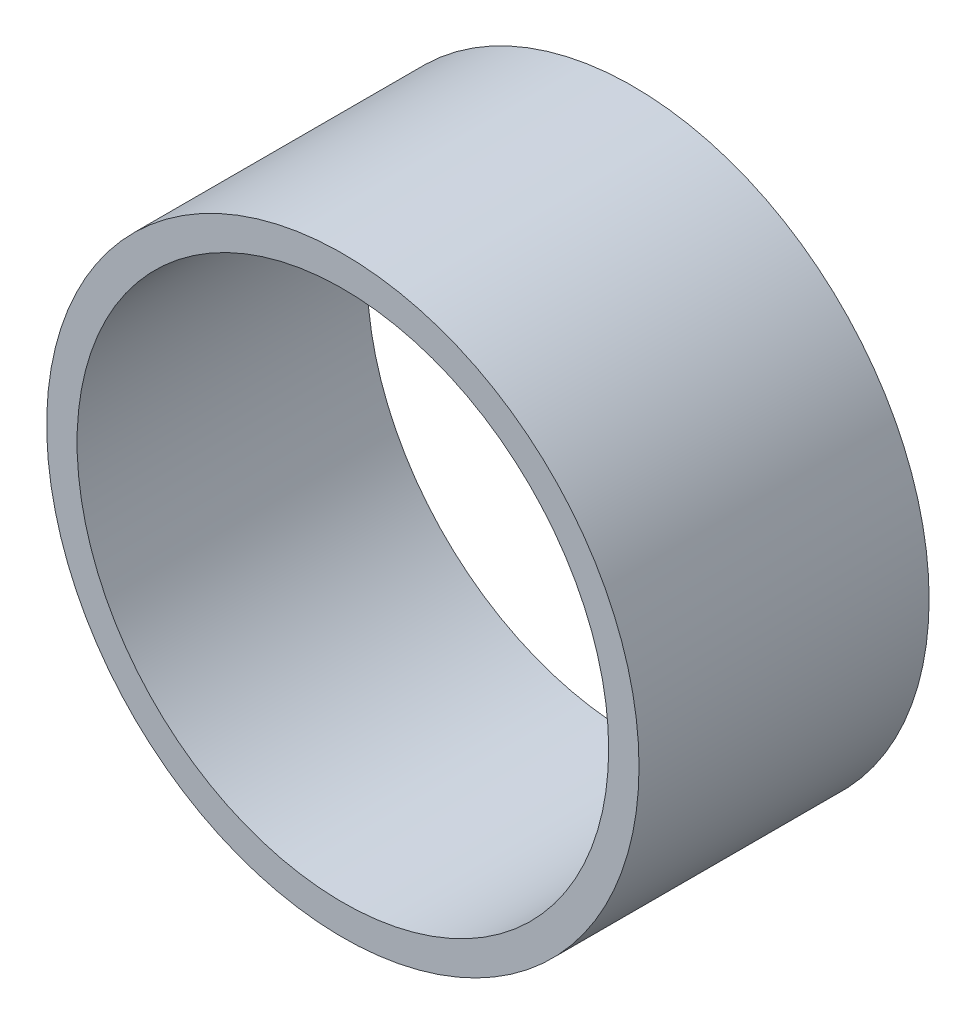
ISO-10303-21;
HEADER;
FILE_DESCRIPTION(('STEP AP214'),'2;1');
FILE_NAME('part.step','',(''),(''),'','','');
FILE_SCHEMA(('AUTOMOTIVE_DESIGN { 1 0 10303 214 1 1 1 1 }'));
ENDSEC;
DATA;
#1=APPLICATION_CONTEXT('core data for automotive mechanical design processes');
#2=APPLICATION_PROTOCOL_DEFINITION('international standard','automotive_design',2000,#1);
#3=PRODUCT_CONTEXT('',#1,'mechanical');
#4=PRODUCT('Part','Part','',(#3));
#5=PRODUCT_RELATED_PRODUCT_CATEGORY('part','',(#4));
#6=PRODUCT_DEFINITION_FORMATION('','',#4);
#7=PRODUCT_DEFINITION_CONTEXT('part definition',#1,'design');
#8=PRODUCT_DEFINITION('design','',#6,#7);
#9=PRODUCT_DEFINITION_SHAPE('','',#8);
#10=(LENGTH_UNIT() NAMED_UNIT(*) SI_UNIT(.MILLI.,.METRE.));
#11=(NAMED_UNIT(*) PLANE_ANGLE_UNIT() SI_UNIT($,.RADIAN.));
#12=(NAMED_UNIT(*) SI_UNIT($,.STERADIAN.) SOLID_ANGLE_UNIT());
#13=UNCERTAINTY_MEASURE_WITH_UNIT(LENGTH_MEASURE(1.E-05),#10,'distance_accuracy_value','');
#14=(GEOMETRIC_REPRESENTATION_CONTEXT(3) GLOBAL_UNCERTAINTY_ASSIGNED_CONTEXT((#13)) GLOBAL_UNIT_ASSIGNED_CONTEXT((#10,
#11,#12)) REPRESENTATION_CONTEXT('',''));
#15=CARTESIAN_POINT('',(0.,0.,0.));
#16=DIRECTION('',(0.,0.,1.));
#17=DIRECTION('',(1.,0.,0.));
#18=AXIS2_PLACEMENT_3D('',#15,#16,#17);
#19=CARTESIAN_POINT('',(0.,0.,2.5));
#20=DIRECTION('',(0.,0.,1.));
#21=DIRECTION('',(1.,0.,0.));
#22=AXIS2_PLACEMENT_3D('',#19,#20,#21);
#23=PLANE('',#22);
#24=CARTESIAN_POINT('',(0.,0.,2.5));
#25=DIRECTION('',(0.,0.,1.));
#26=DIRECTION('',(1.,0.,0.));
#27=AXIS2_PLACEMENT_3D('',#24,#25,#26);
#28=CIRCLE('',#27,2.55235059760956);
#29=CARTESIAN_POINT('',(2.55235059760956,0.,2.5));
#30=VERTEX_POINT('',#29);
#31=EDGE_CURVE('E10',#30,#30,#28,.T.);
#32=ORIENTED_EDGE('',*,*,#31,.T.);
#33=EDGE_LOOP('',(#32));
#34=FACE_BOUND('',#33,.T.);
#35=CARTESIAN_POINT('',(0.,0.,2.5));
#36=DIRECTION('',(0.,0.,1.));
#37=DIRECTION('',(1.,0.,0.));
#38=AXIS2_PLACEMENT_3D('',#35,#36,#37);
#39=CIRCLE('',#38,2.2907087094617);
#40=CARTESIAN_POINT('',(2.2907087094617,0.,2.5));
#41=VERTEX_POINT('',#40);
#42=EDGE_CURVE('E56',#41,#41,#39,.T.);
#43=ORIENTED_EDGE('',*,*,#42,.F.);
#44=EDGE_LOOP('',(#43));
#45=FACE_BOUND('',#44,.T.);
#46=ADVANCED_FACE('F43',(#34,#45),#23,.T.);
#47=CARTESIAN_POINT('',(0.,0.,0.));
#48=DIRECTION('',(0.,0.,1.));
#49=DIRECTION('',(1.,0.,0.));
#50=AXIS2_PLACEMENT_3D('',#47,#48,#49);
#51=PLANE('',#50);
#52=CARTESIAN_POINT('',(0.,0.,0.));
#53=DIRECTION('',(0.,0.,1.));
#54=DIRECTION('',(1.,0.,0.));
#55=AXIS2_PLACEMENT_3D('',#52,#53,#54);
#56=CIRCLE('',#55,2.55235059760956);
#57=CARTESIAN_POINT('',(2.55235059760956,0.,0.));
#58=VERTEX_POINT('',#57);
#59=EDGE_CURVE('E47',#58,#58,#56,.T.);
#60=ORIENTED_EDGE('',*,*,#59,.F.);
#61=EDGE_LOOP('',(#60));
#62=FACE_BOUND('',#61,.T.);
#63=CARTESIAN_POINT('',(0.,0.,0.));
#64=DIRECTION('',(0.,0.,1.));
#65=DIRECTION('',(1.,0.,0.));
#66=AXIS2_PLACEMENT_3D('',#63,#64,#65);
#67=CIRCLE('',#66,2.2907087094617);
#68=CARTESIAN_POINT('',(2.2907087094617,0.,0.));
#69=VERTEX_POINT('',#68);
#70=EDGE_CURVE('E58',#69,#69,#67,.T.);
#71=ORIENTED_EDGE('',*,*,#70,.T.);
#72=EDGE_LOOP('',(#71));
#73=FACE_BOUND('',#72,.T.);
#74=ADVANCED_FACE('F70',(#62,#73),#51,.F.);
#75=CARTESIAN_POINT('',(0.,0.,2.5));
#76=DIRECTION('',(0.,0.,-1.));
#77=DIRECTION('',(-1.,0.,0.));
#78=AXIS2_PLACEMENT_3D('',#75,#76,#77);
#79=CYLINDRICAL_SURFACE('',#78,2.55235059760956);
#80=ORIENTED_EDGE('',*,*,#31,.F.);
#81=EDGE_LOOP('',(#80));
#82=FACE_BOUND('',#81,.T.);
#83=ORIENTED_EDGE('',*,*,#59,.T.);
#84=EDGE_LOOP('',(#83));
#85=FACE_BOUND('',#84,.T.);
#86=ADVANCED_FACE('F45',(#82,#85),#79,.T.);
#87=CARTESIAN_POINT('',(0.,0.,2.5));
#88=DIRECTION('',(0.,0.,-1.));
#89=DIRECTION('',(-1.,0.,0.));
#90=AXIS2_PLACEMENT_3D('',#87,#88,#89);
#91=CYLINDRICAL_SURFACE('',#90,2.2907087094617);
#92=ORIENTED_EDGE('',*,*,#42,.T.);
#93=EDGE_LOOP('',(#92));
#94=FACE_BOUND('',#93,.T.);
#95=ORIENTED_EDGE('',*,*,#70,.F.);
#96=EDGE_LOOP('',(#95));
#97=FACE_BOUND('',#96,.T.);
#98=ADVANCED_FACE('F66',(#94,#97),#91,.F.);
#99=CLOSED_SHELL('',(#46,#74,#86,#98));
#100=MANIFOLD_SOLID_BREP('B2',#99);
#101=ADVANCED_BREP_SHAPE_REPRESENTATION('',(#18,#100),#14);
#102=SHAPE_DEFINITION_REPRESENTATION(#9,#101);
ENDSEC;
END-ISO-10303-21;
